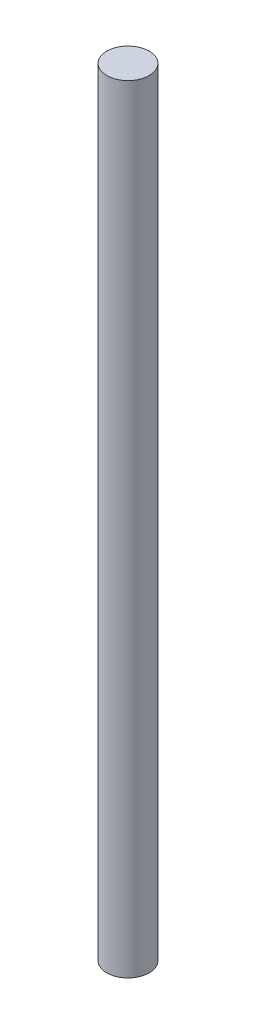
ISO-10303-21;
HEADER;
FILE_DESCRIPTION(('STEP AP214'),'2;1');
FILE_NAME('part.step','',(''),(''),'','','');
FILE_SCHEMA(('AUTOMOTIVE_DESIGN { 1 0 10303 214 1 1 1 1 }'));
ENDSEC;
DATA;
#1=APPLICATION_CONTEXT('core data for automotive mechanical design processes');
#2=APPLICATION_PROTOCOL_DEFINITION('international standard','automotive_design',2000,#1);
#3=PRODUCT_CONTEXT('',#1,'mechanical');
#4=PRODUCT('Part','Part','',(#3));
#5=PRODUCT_RELATED_PRODUCT_CATEGORY('part','',(#4));
#6=PRODUCT_DEFINITION_FORMATION('','',#4);
#7=PRODUCT_DEFINITION_CONTEXT('part definition',#1,'design');
#8=PRODUCT_DEFINITION('design','',#6,#7);
#9=PRODUCT_DEFINITION_SHAPE('','',#8);
#10=(LENGTH_UNIT() NAMED_UNIT(*) SI_UNIT(.MILLI.,.METRE.));
#11=(NAMED_UNIT(*) PLANE_ANGLE_UNIT() SI_UNIT($,.RADIAN.));
#12=(NAMED_UNIT(*) SI_UNIT($,.STERADIAN.) SOLID_ANGLE_UNIT());
#13=UNCERTAINTY_MEASURE_WITH_UNIT(LENGTH_MEASURE(1.E-05),#10,'distance_accuracy_value','');
#14=(GEOMETRIC_REPRESENTATION_CONTEXT(3) GLOBAL_UNCERTAINTY_ASSIGNED_CONTEXT((#13)) GLOBAL_UNIT_ASSIGNED_CONTEXT((#10,
#11,#12)) REPRESENTATION_CONTEXT('',''));
#15=CARTESIAN_POINT('',(0.,0.,0.));
#16=DIRECTION('',(0.,0.,1.));
#17=DIRECTION('',(1.,0.,0.));
#18=AXIS2_PLACEMENT_3D('',#15,#16,#17);
#19=CARTESIAN_POINT('',(0.,55.,0.));
#20=DIRECTION('',(0.,-1.,0.));
#21=DIRECTION('',(0.,0.,-1.));
#22=AXIS2_PLACEMENT_3D('',#19,#20,#21);
#23=CYLINDRICAL_SURFACE('',#22,1.5);
#24=CARTESIAN_POINT('',(0.,55.,0.));
#25=DIRECTION('',(0.,1.,0.));
#26=DIRECTION('',(0.,0.,1.));
#27=AXIS2_PLACEMENT_3D('',#24,#25,#26);
#28=CIRCLE('',#27,1.5);
#29=CARTESIAN_POINT('',(0.,55.,1.5));
#30=VERTEX_POINT('',#29);
#31=EDGE_CURVE('E10',#30,#30,#28,.T.);
#32=ORIENTED_EDGE('',*,*,#31,.F.);
#33=EDGE_LOOP('',(#32));
#34=FACE_BOUND('',#33,.T.);
#35=CARTESIAN_POINT('',(0.,0.,0.));
#36=DIRECTION('',(0.,1.,0.));
#37=DIRECTION('',(0.,0.,1.));
#38=AXIS2_PLACEMENT_3D('',#35,#36,#37);
#39=CIRCLE('',#38,1.5);
#40=CARTESIAN_POINT('',(0.,0.,1.5));
#41=VERTEX_POINT('',#40);
#42=EDGE_CURVE('E34',#41,#41,#39,.T.);
#43=ORIENTED_EDGE('',*,*,#42,.T.);
#44=EDGE_LOOP('',(#43));
#45=FACE_BOUND('',#44,.T.);
#46=ADVANCED_FACE('F31',(#34,#45),#23,.T.);
#47=CARTESIAN_POINT('',(0.,55.,0.));
#48=DIRECTION('',(0.,1.,0.));
#49=DIRECTION('',(0.,0.,1.));
#50=AXIS2_PLACEMENT_3D('',#47,#48,#49);
#51=PLANE('',#50);
#52=ORIENTED_EDGE('',*,*,#31,.T.);
#53=EDGE_LOOP('',(#52));
#54=FACE_BOUND('',#53,.T.);
#55=ADVANCED_FACE('F46',(#54),#51,.T.);
#56=CARTESIAN_POINT('',(0.,0.,0.));
#57=DIRECTION('',(0.,1.,0.));
#58=DIRECTION('',(0.,0.,1.));
#59=AXIS2_PLACEMENT_3D('',#56,#57,#58);
#60=PLANE('',#59);
#61=ORIENTED_EDGE('',*,*,#42,.F.);
#62=EDGE_LOOP('',(#61));
#63=FACE_BOUND('',#62,.T.);
#64=ADVANCED_FACE('F44',(#63),#60,.F.);
#65=CLOSED_SHELL('',(#46,#55,#64));
#66=MANIFOLD_SOLID_BREP('B2',#65);
#67=ADVANCED_BREP_SHAPE_REPRESENTATION('',(#18,#66),#14);
#68=SHAPE_DEFINITION_REPRESENTATION(#9,#67);
ENDSEC;
END-ISO-10303-21;
